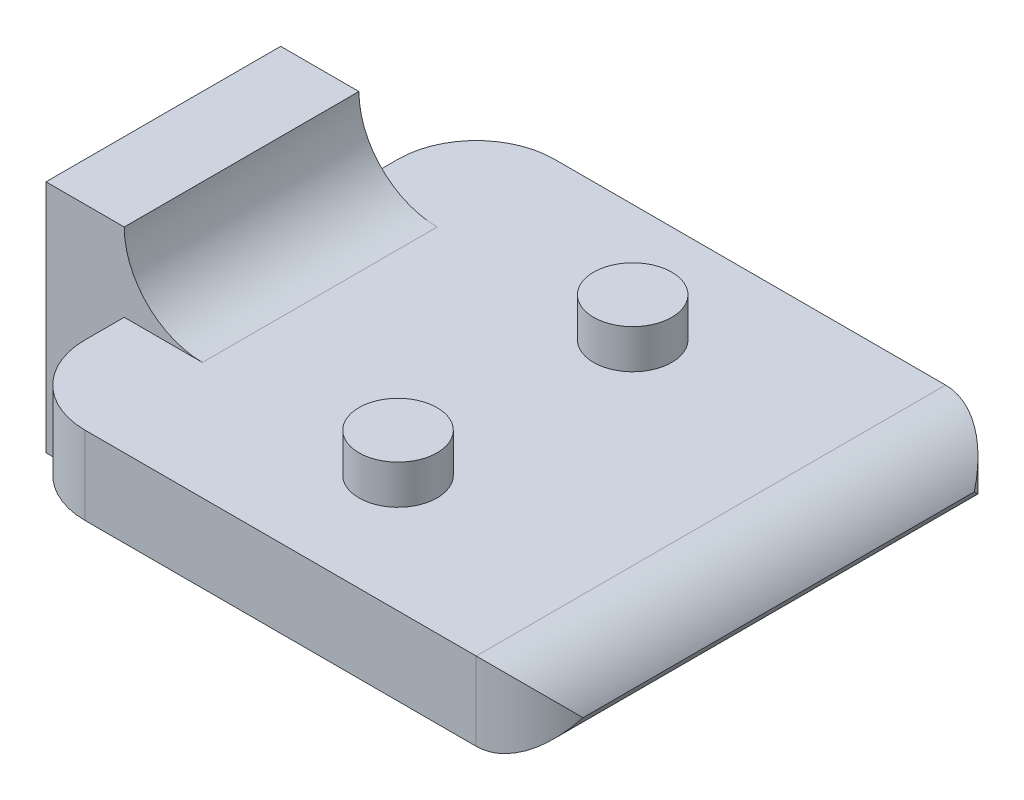
ISO-10303-21;
HEADER;
FILE_DESCRIPTION(('STEP AP214'),'2;1');
FILE_NAME('part.step','',(''),(''),'','','');
FILE_SCHEMA(('AUTOMOTIVE_DESIGN { 1 0 10303 214 1 1 1 1 }'));
ENDSEC;
DATA;
#1=APPLICATION_CONTEXT('core data for automotive mechanical design processes');
#2=APPLICATION_PROTOCOL_DEFINITION('international standard','automotive_design',2000,#1);
#3=PRODUCT_CONTEXT('',#1,'mechanical');
#4=PRODUCT('Part','Part','',(#3));
#5=PRODUCT_RELATED_PRODUCT_CATEGORY('part','',(#4));
#6=PRODUCT_DEFINITION_FORMATION('','',#4);
#7=PRODUCT_DEFINITION_CONTEXT('part definition',#1,'design');
#8=PRODUCT_DEFINITION('design','',#6,#7);
#9=PRODUCT_DEFINITION_SHAPE('','',#8);
#10=(LENGTH_UNIT() NAMED_UNIT(*) SI_UNIT(.MILLI.,.METRE.));
#11=(NAMED_UNIT(*) PLANE_ANGLE_UNIT() SI_UNIT($,.RADIAN.));
#12=(NAMED_UNIT(*) SI_UNIT($,.STERADIAN.) SOLID_ANGLE_UNIT());
#13=UNCERTAINTY_MEASURE_WITH_UNIT(LENGTH_MEASURE(1.E-05),#10,'distance_accuracy_value','');
#14=(GEOMETRIC_REPRESENTATION_CONTEXT(3) GLOBAL_UNCERTAINTY_ASSIGNED_CONTEXT((#13)) GLOBAL_UNIT_ASSIGNED_CONTEXT((#10,
#11,#12)) REPRESENTATION_CONTEXT('',''));
#15=CARTESIAN_POINT('',(0.,0.,0.));
#16=DIRECTION('',(0.,0.,1.));
#17=DIRECTION('',(1.,0.,0.));
#18=AXIS2_PLACEMENT_3D('',#15,#16,#17);
#19=CARTESIAN_POINT('',(25.,10.,0.));
#20=DIRECTION('',(0.,0.,-1.));
#21=DIRECTION('',(-1.,0.,0.));
#22=AXIS2_PLACEMENT_3D('',#19,#20,#21);
#23=CYLINDRICAL_SURFACE('',#22,10.);
#24=CARTESIAN_POINT('',(25.,10.,-20.));
#25=DIRECTION('',(0.,0.707106781186547,-0.707106781186547));
#26=DIRECTION('',(0.,-0.707106781186547,-0.707106781186547));
#27=AXIS2_PLACEMENT_3D('',#24,#25,#26);
#28=ELLIPSE('',#27,14.1421356237309,10.);
#29=CARTESIAN_POINT('',(25.,0.,-30.));
#30=VERTEX_POINT('',#29);
#31=CARTESIAN_POINT('',(33.6602540378444,5.,-25.));
#32=VERTEX_POINT('',#31);
#33=EDGE_CURVE('E335',#30,#32,#28,.F.);
#34=ORIENTED_EDGE('',*,*,#33,.T.);
#35=DIRECTION('',(0.,0.,1.));
#36=VECTOR('',#35,1.);
#37=CARTESIAN_POINT('',(33.6602540378444,5.,0.));
#38=LINE('',#37,#36);
#39=CARTESIAN_POINT('',(33.6602540378444,5.,25.));
#40=VERTEX_POINT('',#39);
#41=EDGE_CURVE('E11',#32,#40,#38,.T.);
#42=ORIENTED_EDGE('',*,*,#41,.T.);
#43=CARTESIAN_POINT('',(25.,10.,20.));
#44=DIRECTION('',(0.,-0.707106781186547,-0.707106781186547));
#45=DIRECTION('',(0.,0.707106781186547,-0.707106781186547));
#46=AXIS2_PLACEMENT_3D('',#43,#44,#45);
#47=ELLIPSE('',#46,14.1421356237309,10.);
#48=CARTESIAN_POINT('',(25.,0.,30.));
#49=VERTEX_POINT('',#48);
#50=EDGE_CURVE('E213',#49,#40,#47,.F.);
#51=ORIENTED_EDGE('',*,*,#50,.F.);
#52=DIRECTION('',(0.,0.,1.));
#53=VECTOR('',#52,1.);
#54=CARTESIAN_POINT('',(25.,0.,30.));
#55=LINE('',#54,#53);
#56=EDGE_CURVE('E314',#30,#49,#55,.T.);
#57=ORIENTED_EDGE('',*,*,#56,.F.);
#58=EDGE_LOOP('',(#34,#42,#51,#57));
#59=FACE_BOUND('',#58,.T.);
#60=ADVANCED_FACE('F41',(#59),#23,.T.);
#61=CARTESIAN_POINT('',(25.,10.,-20.));
#62=DIRECTION('',(0.,-1.,0.));
#63=DIRECTION('',(0.,0.,-1.));
#64=AXIS2_PLACEMENT_3D('',#61,#62,#63);
#65=CYLINDRICAL_SURFACE('',#64,10.);
#66=CARTESIAN_POINT('',(25.,0.,-20.));
#67=DIRECTION('',(0.,-0.707106781186547,-0.707106781186547));
#68=DIRECTION('',(0.,-0.707106781186547,0.707106781186547));
#69=AXIS2_PLACEMENT_3D('',#66,#67,#68);
#70=ELLIPSE('',#69,14.1421356237309,10.);
#71=CARTESIAN_POINT('',(25.,10.,-30.));
#72=VERTEX_POINT('',#71);
#73=EDGE_CURVE('E228',#32,#72,#70,.F.);
#74=ORIENTED_EDGE('',*,*,#73,.F.);
#75=ORIENTED_EDGE('',*,*,#33,.F.);
#76=DIRECTION('',(0.,-1.,0.));
#77=VECTOR('',#76,1.);
#78=CARTESIAN_POINT('',(25.,10.,-30.));
#79=LINE('',#78,#77);
#80=EDGE_CURVE('E300',#72,#30,#79,.T.);
#81=ORIENTED_EDGE('',*,*,#80,.F.);
#82=EDGE_LOOP('',(#74,#75,#81));
#83=FACE_BOUND('',#82,.T.);
#84=ADVANCED_FACE('F337',(#83),#65,.T.);
#85=CARTESIAN_POINT('',(25.,0.,0.));
#86=DIRECTION('',(0.,0.,1.));
#87=DIRECTION('',(1.,0.,0.));
#88=AXIS2_PLACEMENT_3D('',#85,#86,#87);
#89=CYLINDRICAL_SURFACE('',#88,10.);
#90=ORIENTED_EDGE('',*,*,#41,.F.);
#91=ORIENTED_EDGE('',*,*,#73,.T.);
#92=DIRECTION('',(0.,0.,1.));
#93=VECTOR('',#92,1.);
#94=CARTESIAN_POINT('',(25.,10.,0.));
#95=LINE('',#94,#93);
#96=CARTESIAN_POINT('',(25.,10.,30.));
#97=VERTEX_POINT('',#96);
#98=EDGE_CURVE('E293',#97,#72,#95,.F.);
#99=ORIENTED_EDGE('',*,*,#98,.F.);
#100=CARTESIAN_POINT('',(25.,0.,20.));
#101=DIRECTION('',(0.,-0.707106781186547,0.707106781186547));
#102=DIRECTION('',(0.,0.707106781186547,0.707106781186547));
#103=AXIS2_PLACEMENT_3D('',#100,#101,#102);
#104=ELLIPSE('',#103,14.1421356237309,10.);
#105=EDGE_CURVE('E329',#40,#97,#104,.T.);
#106=ORIENTED_EDGE('',*,*,#105,.F.);
#107=EDGE_LOOP('',(#90,#91,#99,#106));
#108=FACE_BOUND('',#107,.T.);
#109=ADVANCED_FACE('F333',(#108),#89,.T.);
#110=CARTESIAN_POINT('',(25.,10.,20.));
#111=DIRECTION('',(0.,1.,0.));
#112=DIRECTION('',(0.,0.,1.));
#113=AXIS2_PLACEMENT_3D('',#110,#111,#112);
#114=CYLINDRICAL_SURFACE('',#113,10.);
#115=ORIENTED_EDGE('',*,*,#50,.T.);
#116=ORIENTED_EDGE('',*,*,#105,.T.);
#117=DIRECTION('',(0.,-1.,0.));
#118=VECTOR('',#117,1.);
#119=CARTESIAN_POINT('',(25.,10.,30.));
#120=LINE('',#119,#118);
#121=EDGE_CURVE('E278',#49,#97,#120,.F.);
#122=ORIENTED_EDGE('',*,*,#121,.F.);
#123=EDGE_LOOP('',(#115,#116,#122));
#124=FACE_BOUND('',#123,.T.);
#125=ADVANCED_FACE('F352',(#124),#114,.T.);
#126=CARTESIAN_POINT('',(0.,10.,-15.));
#127=DIRECTION('',(0.,0.,1.));
#128=DIRECTION('',(1.,0.,0.));
#129=AXIS2_PLACEMENT_3D('',#126,#127,#128);
#130=PLANE('',#129);
#131=DIRECTION('',(0.,-1.,0.));
#132=VECTOR('',#131,1.);
#133=CARTESIAN_POINT('',(-35.,10.,-15.));
#134=LINE('',#133,#132);
#135=CARTESIAN_POINT('',(-35.,10.,-15.));
#136=VERTEX_POINT('',#135);
#137=CARTESIAN_POINT('',(-35.,0.,-15.));
#138=VERTEX_POINT('',#137);
#139=EDGE_CURVE('E270',#136,#138,#134,.T.);
#140=ORIENTED_EDGE('',*,*,#139,.T.);
#141=DIRECTION('',(-1.,0.,0.));
#142=VECTOR('',#141,1.);
#143=CARTESIAN_POINT('',(0.,0.,-15.));
#144=LINE('',#143,#142);
#145=CARTESIAN_POINT('',(-25.,0.,-15.));
#146=VERTEX_POINT('',#145);
#147=EDGE_CURVE('E315',#146,#138,#144,.T.);
#148=ORIENTED_EDGE('',*,*,#147,.F.);
#149=CARTESIAN_POINT('',(-25.,-10.,-15.));
#150=DIRECTION('',(0.,0.,1.));
#151=DIRECTION('',(1.,0.,0.));
#152=AXIS2_PLACEMENT_3D('',#149,#150,#151);
#153=CIRCLE('',#152,10.);
#154=CARTESIAN_POINT('',(-35.,-10.,-15.));
#155=VERTEX_POINT('',#154);
#156=EDGE_CURVE('E321',#146,#155,#153,.T.);
#157=ORIENTED_EDGE('',*,*,#156,.T.);
#158=DIRECTION('',(-1.,0.,0.));
#159=VECTOR('',#158,1.);
#160=CARTESIAN_POINT('',(-35.,-10.,-15.));
#161=LINE('',#160,#159);
#162=CARTESIAN_POINT('',(-45.,-10.,-15.));
#163=VERTEX_POINT('',#162);
#164=EDGE_CURVE('E236',#155,#163,#161,.T.);
#165=ORIENTED_EDGE('',*,*,#164,.T.);
#166=DIRECTION('',(0.,-1.,0.));
#167=VECTOR('',#166,1.);
#168=CARTESIAN_POINT('',(-45.,10.,-15.));
#169=LINE('',#168,#167);
#170=CARTESIAN_POINT('',(-45.,20.,-15.));
#171=VERTEX_POINT('',#170);
#172=EDGE_CURVE('E274',#171,#163,#169,.T.);
#173=ORIENTED_EDGE('',*,*,#172,.F.);
#174=DIRECTION('',(-1.,0.,0.));
#175=VECTOR('',#174,1.);
#176=CARTESIAN_POINT('',(-35.,20.,-15.));
#177=LINE('',#176,#175);
#178=CARTESIAN_POINT('',(-35.,20.,-15.));
#179=VERTEX_POINT('',#178);
#180=EDGE_CURVE('E223',#179,#171,#177,.T.);
#181=ORIENTED_EDGE('',*,*,#180,.F.);
#182=CARTESIAN_POINT('',(-25.,20.,-15.));
#183=DIRECTION('',(0.,0.,1.));
#184=DIRECTION('',(1.,0.,0.));
#185=AXIS2_PLACEMENT_3D('',#182,#183,#184);
#186=CIRCLE('',#185,10.);
#187=CARTESIAN_POINT('',(-25.,10.,-15.));
#188=VERTEX_POINT('',#187);
#189=EDGE_CURVE('E324',#179,#188,#186,.T.);
#190=ORIENTED_EDGE('',*,*,#189,.T.);
#191=DIRECTION('',(1.,0.,0.));
#192=VECTOR('',#191,1.);
#193=CARTESIAN_POINT('',(0.,10.,-15.));
#194=LINE('',#193,#192);
#195=EDGE_CURVE('E295',#136,#188,#194,.T.);
#196=ORIENTED_EDGE('',*,*,#195,.F.);
#197=EDGE_LOOP('',(#140,#148,#157,#165,#173,#181,#190,#196));
#198=FACE_BOUND('',#197,.T.);
#199=ADVANCED_FACE('F380',(#198),#130,.F.);
#200=CARTESIAN_POINT('',(-45.,10.,0.));
#201=DIRECTION('',(1.,0.,0.));
#202=DIRECTION('',(0.,0.,-1.));
#203=AXIS2_PLACEMENT_3D('',#200,#201,#202);
#204=PLANE('',#203);
#205=DIRECTION('',(0.,0.,-1.));
#206=VECTOR('',#205,1.);
#207=CARTESIAN_POINT('',(-45.,8.19970086177524,-8.13904491053576));
#208=LINE('',#207,#206);
#209=CARTESIAN_POINT('',(-45.,8.19970086177524,8.13904491053578));
#210=VERTEX_POINT('',#209);
#211=CARTESIAN_POINT('',(-45.,8.19970086177524,-8.13904491053576));
#212=VERTEX_POINT('',#211);
#213=EDGE_CURVE('E199',#210,#212,#208,.T.);
#214=ORIENTED_EDGE('',*,*,#213,.F.);
#215=DIRECTION('',(0.,1.,0.));
#216=VECTOR('',#215,1.);
#217=CARTESIAN_POINT('',(-45.,8.19970086177524,8.13904491053578));
#218=LINE('',#217,#216);
#219=CARTESIAN_POINT('',(-45.,1.80029913822476,8.13904491053578));
#220=VERTEX_POINT('',#219);
#221=EDGE_CURVE('E57',#220,#210,#218,.T.);
#222=ORIENTED_EDGE('',*,*,#221,.F.);
#223=DIRECTION('',(0.,0.,1.));
#224=VECTOR('',#223,1.);
#225=CARTESIAN_POINT('',(-45.,1.80029913822476,-8.13904491053576));
#226=LINE('',#225,#224);
#227=CARTESIAN_POINT('',(-45.,1.80029913822476,-8.13904491053576));
#228=VERTEX_POINT('',#227);
#229=EDGE_CURVE('E193',#228,#220,#226,.T.);
#230=ORIENTED_EDGE('',*,*,#229,.F.);
#231=DIRECTION('',(0.,-1.,0.));
#232=VECTOR('',#231,1.);
#233=CARTESIAN_POINT('',(-45.,8.19970086177524,-8.13904491053576));
#234=LINE('',#233,#232);
#235=EDGE_CURVE('E195',#212,#228,#234,.T.);
#236=ORIENTED_EDGE('',*,*,#235,.F.);
#237=EDGE_LOOP('',(#214,#222,#230,#236));
#238=FACE_BOUND('',#237,.T.);
#239=ORIENTED_EDGE('',*,*,#172,.T.);
#240=DIRECTION('',(0.,0.,1.));
#241=VECTOR('',#240,1.);
#242=CARTESIAN_POINT('',(-45.,-10.,-15.));
#243=LINE('',#242,#241);
#244=CARTESIAN_POINT('',(-45.,-10.,15.));
#245=VERTEX_POINT('',#244);
#246=EDGE_CURVE('E243',#163,#245,#243,.T.);
#247=ORIENTED_EDGE('',*,*,#246,.T.);
#248=DIRECTION('',(0.,-1.,0.));
#249=VECTOR('',#248,1.);
#250=CARTESIAN_POINT('',(-45.,10.,15.));
#251=LINE('',#250,#249);
#252=CARTESIAN_POINT('',(-45.,20.,15.));
#253=VERTEX_POINT('',#252);
#254=EDGE_CURVE('E272',#253,#245,#251,.T.);
#255=ORIENTED_EDGE('',*,*,#254,.F.);
#256=DIRECTION('',(0.,0.,1.));
#257=VECTOR('',#256,1.);
#258=CARTESIAN_POINT('',(-45.,20.,-15.));
#259=LINE('',#258,#257);
#260=EDGE_CURVE('E230',#171,#253,#259,.T.);
#261=ORIENTED_EDGE('',*,*,#260,.F.);
#262=EDGE_LOOP('',(#239,#247,#255,#261));
#263=FACE_BOUND('',#262,.T.);
#264=ADVANCED_FACE('F400',(#238,#263),#204,.F.);
#265=CARTESIAN_POINT('',(0.,10.,15.));
#266=DIRECTION('',(0.,0.,1.));
#267=DIRECTION('',(1.,0.,0.));
#268=AXIS2_PLACEMENT_3D('',#265,#266,#267);
#269=PLANE('',#268);
#270=ORIENTED_EDGE('',*,*,#254,.T.);
#271=DIRECTION('',(1.,0.,0.));
#272=VECTOR('',#271,1.);
#273=CARTESIAN_POINT('',(-35.,-10.,15.));
#274=LINE('',#273,#272);
#275=CARTESIAN_POINT('',(-35.,-10.,15.));
#276=VERTEX_POINT('',#275);
#277=EDGE_CURVE('E245',#245,#276,#274,.T.);
#278=ORIENTED_EDGE('',*,*,#277,.T.);
#279=CARTESIAN_POINT('',(-25.,-10.,15.));
#280=DIRECTION('',(0.,0.,1.));
#281=DIRECTION('',(1.,0.,0.));
#282=AXIS2_PLACEMENT_3D('',#279,#280,#281);
#283=CIRCLE('',#282,10.);
#284=CARTESIAN_POINT('',(-25.,0.,15.));
#285=VERTEX_POINT('',#284);
#286=EDGE_CURVE('E323',#276,#285,#283,.F.);
#287=ORIENTED_EDGE('',*,*,#286,.T.);
#288=DIRECTION('',(1.,0.,0.));
#289=VECTOR('',#288,1.);
#290=CARTESIAN_POINT('',(0.,0.,15.));
#291=LINE('',#290,#289);
#292=CARTESIAN_POINT('',(-35.,0.,15.));
#293=VERTEX_POINT('',#292);
#294=EDGE_CURVE('E308',#293,#285,#291,.T.);
#295=ORIENTED_EDGE('',*,*,#294,.F.);
#296=DIRECTION('',(0.,-1.,0.));
#297=VECTOR('',#296,1.);
#298=CARTESIAN_POINT('',(-35.,10.,15.));
#299=LINE('',#298,#297);
#300=CARTESIAN_POINT('',(-35.,10.,15.));
#301=VERTEX_POINT('',#300);
#302=EDGE_CURVE('E269',#301,#293,#299,.T.);
#303=ORIENTED_EDGE('',*,*,#302,.F.);
#304=DIRECTION('',(-1.,0.,0.));
#305=VECTOR('',#304,1.);
#306=CARTESIAN_POINT('',(0.,10.,15.));
#307=LINE('',#306,#305);
#308=CARTESIAN_POINT('',(-25.,10.,15.));
#309=VERTEX_POINT('',#308);
#310=EDGE_CURVE('E289',#309,#301,#307,.T.);
#311=ORIENTED_EDGE('',*,*,#310,.F.);
#312=CARTESIAN_POINT('',(-25.,20.,15.));
#313=DIRECTION('',(0.,0.,1.));
#314=DIRECTION('',(1.,0.,0.));
#315=AXIS2_PLACEMENT_3D('',#312,#313,#314);
#316=CIRCLE('',#315,10.);
#317=CARTESIAN_POINT('',(-35.,20.,15.));
#318=VERTEX_POINT('',#317);
#319=EDGE_CURVE('E47',#309,#318,#316,.F.);
#320=ORIENTED_EDGE('',*,*,#319,.T.);
#321=DIRECTION('',(1.,0.,0.));
#322=VECTOR('',#321,1.);
#323=CARTESIAN_POINT('',(-35.,20.,15.));
#324=LINE('',#323,#322);
#325=EDGE_CURVE('E234',#253,#318,#324,.T.);
#326=ORIENTED_EDGE('',*,*,#325,.F.);
#327=EDGE_LOOP('',(#270,#278,#287,#295,#303,#311,#320,#326));
#328=FACE_BOUND('',#327,.T.);
#329=ADVANCED_FACE('F369',(#328),#269,.T.);
#330=CARTESIAN_POINT('',(-35.,10.,0.));
#331=DIRECTION('',(1.,0.,0.));
#332=DIRECTION('',(0.,0.,-1.));
#333=AXIS2_PLACEMENT_3D('',#330,#331,#332);
#334=PLANE('',#333);
#335=DIRECTION('',(0.,0.,1.));
#336=VECTOR('',#335,1.);
#337=CARTESIAN_POINT('',(-35.,0.,0.));
#338=LINE('',#337,#336);
#339=CARTESIAN_POINT('',(-35.,0.,20.));
#340=VERTEX_POINT('',#339);
#341=EDGE_CURVE('E249',#293,#340,#338,.T.);
#342=ORIENTED_EDGE('',*,*,#341,.T.);
#343=DIRECTION('',(0.,-1.,0.));
#344=VECTOR('',#343,1.);
#345=CARTESIAN_POINT('',(-35.,10.,20.));
#346=LINE('',#345,#344);
#347=CARTESIAN_POINT('',(-35.,10.,20.));
#348=VERTEX_POINT('',#347);
#349=EDGE_CURVE('E317',#340,#348,#346,.F.);
#350=ORIENTED_EDGE('',*,*,#349,.T.);
#351=DIRECTION('',(0.,0.,1.));
#352=VECTOR('',#351,1.);
#353=CARTESIAN_POINT('',(-35.,10.,0.));
#354=LINE('',#353,#352);
#355=EDGE_CURVE('E247',#301,#348,#354,.T.);
#356=ORIENTED_EDGE('',*,*,#355,.F.);
#357=ORIENTED_EDGE('',*,*,#302,.T.);
#358=EDGE_LOOP('',(#342,#350,#356,#357));
#359=FACE_BOUND('',#358,.T.);
#360=ADVANCED_FACE('F368',(#359),#334,.F.);
#361=CARTESIAN_POINT('',(0.,10.,30.));
#362=DIRECTION('',(0.,0.,-1.));
#363=DIRECTION('',(-1.,0.,0.));
#364=AXIS2_PLACEMENT_3D('',#361,#362,#363);
#365=PLANE('',#364);
#366=DIRECTION('',(1.,0.,0.));
#367=VECTOR('',#366,1.);
#368=CARTESIAN_POINT('',(0.,0.,30.));
#369=LINE('',#368,#367);
#370=CARTESIAN_POINT('',(-25.,0.,30.));
#371=VERTEX_POINT('',#370);
#372=EDGE_CURVE('E261',#371,#49,#369,.T.);
#373=ORIENTED_EDGE('',*,*,#372,.T.);
#374=ORIENTED_EDGE('',*,*,#121,.T.);
#375=DIRECTION('',(1.,0.,0.));
#376=VECTOR('',#375,1.);
#377=CARTESIAN_POINT('',(0.,10.,30.));
#378=LINE('',#377,#376);
#379=CARTESIAN_POINT('',(-25.,10.,30.));
#380=VERTEX_POINT('',#379);
#381=EDGE_CURVE('E253',#380,#97,#378,.T.);
#382=ORIENTED_EDGE('',*,*,#381,.F.);
#383=DIRECTION('',(0.,-1.,0.));
#384=VECTOR('',#383,1.);
#385=CARTESIAN_POINT('',(-25.,10.,30.));
#386=LINE('',#385,#384);
#387=EDGE_CURVE('E280',#380,#371,#386,.T.);
#388=ORIENTED_EDGE('',*,*,#387,.T.);
#389=EDGE_LOOP('',(#373,#374,#382,#388));
#390=FACE_BOUND('',#389,.T.);
#391=ADVANCED_FACE('F358',(#390),#365,.F.);
#392=CARTESIAN_POINT('',(0.,10.,-30.));
#393=DIRECTION('',(0.,0.,-1.));
#394=DIRECTION('',(-1.,0.,0.));
#395=AXIS2_PLACEMENT_3D('',#392,#393,#394);
#396=PLANE('',#395);
#397=DIRECTION('',(1.,0.,0.));
#398=VECTOR('',#397,1.);
#399=CARTESIAN_POINT('',(0.,10.,-30.));
#400=LINE('',#399,#398);
#401=CARTESIAN_POINT('',(-25.,10.,-30.));
#402=VERTEX_POINT('',#401);
#403=EDGE_CURVE('E258',#402,#72,#400,.T.);
#404=ORIENTED_EDGE('',*,*,#403,.T.);
#405=ORIENTED_EDGE('',*,*,#80,.T.);
#406=DIRECTION('',(1.,0.,0.));
#407=VECTOR('',#406,1.);
#408=CARTESIAN_POINT('',(0.,0.,-30.));
#409=LINE('',#408,#407);
#410=CARTESIAN_POINT('',(-25.,0.,-30.));
#411=VERTEX_POINT('',#410);
#412=EDGE_CURVE('E262',#411,#30,#409,.T.);
#413=ORIENTED_EDGE('',*,*,#412,.F.);
#414=DIRECTION('',(0.,-1.,0.));
#415=VECTOR('',#414,1.);
#416=CARTESIAN_POINT('',(-25.,10.,-30.));
#417=LINE('',#416,#415);
#418=EDGE_CURVE('E299',#411,#402,#417,.F.);
#419=ORIENTED_EDGE('',*,*,#418,.T.);
#420=EDGE_LOOP('',(#404,#405,#413,#419));
#421=FACE_BOUND('',#420,.T.);
#422=ADVANCED_FACE('F343',(#421),#396,.T.);
#423=CARTESIAN_POINT('',(-35.,10.,-20.));
#424=VERTEX_POINT('',#423);
#425=EDGE_CURVE('E251',#424,#136,#354,.T.);
#426=ORIENTED_EDGE('',*,*,#425,.F.);
#427=DIRECTION('',(0.,-1.,0.));
#428=VECTOR('',#427,1.);
#429=CARTESIAN_POINT('',(-35.,0.,-20.));
#430=LINE('',#429,#428);
#431=CARTESIAN_POINT('',(-35.,0.,-20.));
#432=VERTEX_POINT('',#431);
#433=EDGE_CURVE('E316',#424,#432,#430,.T.);
#434=ORIENTED_EDGE('',*,*,#433,.T.);
#435=EDGE_CURVE('E252',#432,#138,#338,.T.);
#436=ORIENTED_EDGE('',*,*,#435,.T.);
#437=ORIENTED_EDGE('',*,*,#139,.F.);
#438=EDGE_LOOP('',(#426,#434,#436,#437));
#439=FACE_BOUND('',#438,.T.);
#440=ADVANCED_FACE('F385',(#439),#334,.F.);
#441=CARTESIAN_POINT('',(0.,10.,0.));
#442=DIRECTION('',(0.,1.,0.));
#443=DIRECTION('',(0.,0.,1.));
#444=AXIS2_PLACEMENT_3D('',#441,#442,#443);
#445=PLANE('',#444);
#446=CARTESIAN_POINT('',(0.,10.,-15.));
#447=DIRECTION('',(0.,1.,0.));
#448=DIRECTION('',(0.,0.,1.));
#449=AXIS2_PLACEMENT_3D('',#446,#447,#448);
#450=CIRCLE('',#449,5.);
#451=CARTESIAN_POINT('',(0.,10.,-10.));
#452=VERTEX_POINT('',#451);
#453=EDGE_CURVE('E212',#452,#452,#450,.T.);
#454=ORIENTED_EDGE('',*,*,#453,.F.);
#455=EDGE_LOOP('',(#454));
#456=FACE_BOUND('',#455,.T.);
#457=CARTESIAN_POINT('',(0.,10.,15.));
#458=DIRECTION('',(0.,1.,0.));
#459=DIRECTION('',(0.,0.,1.));
#460=AXIS2_PLACEMENT_3D('',#457,#458,#459);
#461=CIRCLE('',#460,5.);
#462=CARTESIAN_POINT('',(0.,10.,20.));
#463=VERTEX_POINT('',#462);
#464=EDGE_CURVE('E220',#463,#463,#461,.T.);
#465=ORIENTED_EDGE('',*,*,#464,.F.);
#466=EDGE_LOOP('',(#465));
#467=FACE_BOUND('',#466,.T.);
#468=ORIENTED_EDGE('',*,*,#381,.T.);
#469=ORIENTED_EDGE('',*,*,#98,.T.);
#470=ORIENTED_EDGE('',*,*,#403,.F.);
#471=CARTESIAN_POINT('',(-25.,10.,-20.));
#472=DIRECTION('',(0.,1.,0.));
#473=DIRECTION('',(0.,0.,1.));
#474=AXIS2_PLACEMENT_3D('',#471,#472,#473);
#475=CIRCLE('',#474,10.);
#476=EDGE_CURVE('E281',#402,#424,#475,.T.);
#477=ORIENTED_EDGE('',*,*,#476,.T.);
#478=ORIENTED_EDGE('',*,*,#425,.T.);
#479=ORIENTED_EDGE('',*,*,#195,.T.);
#480=DIRECTION('',(0.,0.,-1.));
#481=VECTOR('',#480,1.);
#482=CARTESIAN_POINT('',(-25.,10.,15.));
#483=LINE('',#482,#481);
#484=EDGE_CURVE('E290',#188,#309,#483,.F.);
#485=ORIENTED_EDGE('',*,*,#484,.T.);
#486=ORIENTED_EDGE('',*,*,#310,.T.);
#487=ORIENTED_EDGE('',*,*,#355,.T.);
#488=CARTESIAN_POINT('',(-25.,10.,20.));
#489=DIRECTION('',(0.,1.,0.));
#490=DIRECTION('',(0.,0.,1.));
#491=AXIS2_PLACEMENT_3D('',#488,#489,#490);
#492=CIRCLE('',#491,10.);
#493=EDGE_CURVE('E282',#348,#380,#492,.T.);
#494=ORIENTED_EDGE('',*,*,#493,.T.);
#495=EDGE_LOOP('',(#468,#469,#470,#477,#478,#479,#485,#486,#487,#494));
#496=FACE_BOUND('',#495,.T.);
#497=ADVANCED_FACE('F360',(#456,#467,#496),#445,.T.);
#498=CARTESIAN_POINT('',(0.,0.,0.));
#499=DIRECTION('',(0.,1.,0.));
#500=DIRECTION('',(0.,0.,1.));
#501=AXIS2_PLACEMENT_3D('',#498,#499,#500);
#502=PLANE('',#501);
#503=ORIENTED_EDGE('',*,*,#412,.T.);
#504=ORIENTED_EDGE('',*,*,#56,.T.);
#505=ORIENTED_EDGE('',*,*,#372,.F.);
#506=CARTESIAN_POINT('',(-25.,0.,20.));
#507=DIRECTION('',(0.,1.,0.));
#508=DIRECTION('',(0.,0.,1.));
#509=AXIS2_PLACEMENT_3D('',#506,#507,#508);
#510=CIRCLE('',#509,10.);
#511=EDGE_CURVE('E304',#371,#340,#510,.F.);
#512=ORIENTED_EDGE('',*,*,#511,.T.);
#513=ORIENTED_EDGE('',*,*,#341,.F.);
#514=ORIENTED_EDGE('',*,*,#294,.T.);
#515=DIRECTION('',(0.,0.,-1.));
#516=VECTOR('',#515,1.);
#517=CARTESIAN_POINT('',(-25.,0.,0.));
#518=LINE('',#517,#516);
#519=EDGE_CURVE('E310',#285,#146,#518,.T.);
#520=ORIENTED_EDGE('',*,*,#519,.T.);
#521=ORIENTED_EDGE('',*,*,#147,.T.);
#522=ORIENTED_EDGE('',*,*,#435,.F.);
#523=CARTESIAN_POINT('',(-25.,0.,-20.));
#524=DIRECTION('',(0.,1.,0.));
#525=DIRECTION('',(0.,0.,1.));
#526=AXIS2_PLACEMENT_3D('',#523,#524,#525);
#527=CIRCLE('',#526,10.);
#528=EDGE_CURVE('E305',#432,#411,#527,.F.);
#529=ORIENTED_EDGE('',*,*,#528,.T.);
#530=EDGE_LOOP('',(#503,#504,#505,#512,#513,#514,#520,#521,#522,#529));
#531=FACE_BOUND('',#530,.T.);
#532=ADVANCED_FACE('F347',(#531),#502,.F.);
#533=CARTESIAN_POINT('',(0.,-10.,0.));
#534=DIRECTION('',(0.,-1.,0.));
#535=DIRECTION('',(0.,0.,-1.));
#536=AXIS2_PLACEMENT_3D('',#533,#534,#535);
#537=PLANE('',#536);
#538=DIRECTION('',(0.,0.,-1.));
#539=VECTOR('',#538,1.);
#540=CARTESIAN_POINT('',(-35.,-10.,-15.));
#541=LINE('',#540,#539);
#542=EDGE_CURVE('E231',#276,#155,#541,.T.);
#543=ORIENTED_EDGE('',*,*,#542,.F.);
#544=ORIENTED_EDGE('',*,*,#277,.F.);
#545=ORIENTED_EDGE('',*,*,#246,.F.);
#546=ORIENTED_EDGE('',*,*,#164,.F.);
#547=EDGE_LOOP('',(#543,#544,#545,#546));
#548=FACE_BOUND('',#547,.T.);
#549=ADVANCED_FACE('F401',(#548),#537,.T.);
#550=CARTESIAN_POINT('',(0.,20.,0.));
#551=DIRECTION('',(0.,-1.,0.));
#552=DIRECTION('',(0.,0.,-1.));
#553=AXIS2_PLACEMENT_3D('',#550,#551,#552);
#554=PLANE('',#553);
#555=DIRECTION('',(0.,0.,-1.));
#556=VECTOR('',#555,1.);
#557=CARTESIAN_POINT('',(-35.,20.,-15.));
#558=LINE('',#557,#556);
#559=EDGE_CURVE('E225',#318,#179,#558,.T.);
#560=ORIENTED_EDGE('',*,*,#559,.T.);
#561=ORIENTED_EDGE('',*,*,#180,.T.);
#562=ORIENTED_EDGE('',*,*,#260,.T.);
#563=ORIENTED_EDGE('',*,*,#325,.T.);
#564=EDGE_LOOP('',(#560,#561,#562,#563));
#565=FACE_BOUND('',#564,.T.);
#566=ADVANCED_FACE('F398',(#565),#554,.F.);
#567=CARTESIAN_POINT('',(-25.,-10.,0.));
#568=DIRECTION('',(0.,0.,-1.));
#569=DIRECTION('',(-1.,0.,0.));
#570=AXIS2_PLACEMENT_3D('',#567,#568,#569);
#571=CYLINDRICAL_SURFACE('',#570,10.);
#572=ORIENTED_EDGE('',*,*,#286,.F.);
#573=ORIENTED_EDGE('',*,*,#542,.T.);
#574=ORIENTED_EDGE('',*,*,#156,.F.);
#575=ORIENTED_EDGE('',*,*,#519,.F.);
#576=EDGE_LOOP('',(#572,#573,#574,#575));
#577=FACE_BOUND('',#576,.T.);
#578=ADVANCED_FACE('F373',(#577),#571,.F.);
#579=CARTESIAN_POINT('',(-25.,20.,-15.));
#580=DIRECTION('',(0.,0.,1.));
#581=DIRECTION('',(1.,0.,0.));
#582=AXIS2_PLACEMENT_3D('',#579,#580,#581);
#583=CYLINDRICAL_SURFACE('',#582,10.);
#584=ORIENTED_EDGE('',*,*,#319,.F.);
#585=ORIENTED_EDGE('',*,*,#484,.F.);
#586=ORIENTED_EDGE('',*,*,#189,.F.);
#587=ORIENTED_EDGE('',*,*,#559,.F.);
#588=EDGE_LOOP('',(#584,#585,#586,#587));
#589=FACE_BOUND('',#588,.T.);
#590=ADVANCED_FACE('F393',(#589),#583,.F.);
#591=CARTESIAN_POINT('',(-25.,10.,-20.));
#592=DIRECTION('',(0.,1.,0.));
#593=DIRECTION('',(0.,0.,1.));
#594=AXIS2_PLACEMENT_3D('',#591,#592,#593);
#595=CYLINDRICAL_SURFACE('',#594,10.);
#596=ORIENTED_EDGE('',*,*,#476,.F.);
#597=ORIENTED_EDGE('',*,*,#418,.F.);
#598=ORIENTED_EDGE('',*,*,#528,.F.);
#599=ORIENTED_EDGE('',*,*,#433,.F.);
#600=EDGE_LOOP('',(#596,#597,#598,#599));
#601=FACE_BOUND('',#600,.T.);
#602=ADVANCED_FACE('F390',(#601),#595,.T.);
#603=CARTESIAN_POINT('',(-25.,10.,20.));
#604=DIRECTION('',(0.,-1.,0.));
#605=DIRECTION('',(0.,0.,-1.));
#606=AXIS2_PLACEMENT_3D('',#603,#604,#605);
#607=CYLINDRICAL_SURFACE('',#606,10.);
#608=ORIENTED_EDGE('',*,*,#493,.F.);
#609=ORIENTED_EDGE('',*,*,#349,.F.);
#610=ORIENTED_EDGE('',*,*,#511,.F.);
#611=ORIENTED_EDGE('',*,*,#387,.F.);
#612=EDGE_LOOP('',(#608,#609,#610,#611));
#613=FACE_BOUND('',#612,.T.);
#614=ADVANCED_FACE('F43',(#613),#607,.T.);
#615=CARTESIAN_POINT('',(0.,15.,15.));
#616=DIRECTION('',(0.,-1.,0.));
#617=DIRECTION('',(0.,0.,-1.));
#618=AXIS2_PLACEMENT_3D('',#615,#616,#617);
#619=CYLINDRICAL_SURFACE('',#618,5.);
#620=CARTESIAN_POINT('',(0.,15.,15.));
#621=DIRECTION('',(0.,1.,0.));
#622=DIRECTION('',(0.,0.,1.));
#623=AXIS2_PLACEMENT_3D('',#620,#621,#622);
#624=CIRCLE('',#623,5.);
#625=CARTESIAN_POINT('',(0.,15.,20.));
#626=VERTEX_POINT('',#625);
#627=EDGE_CURVE('E206',#626,#626,#624,.T.);
#628=ORIENTED_EDGE('',*,*,#627,.F.);
#629=EDGE_LOOP('',(#628));
#630=FACE_BOUND('',#629,.T.);
#631=ORIENTED_EDGE('',*,*,#464,.T.);
#632=EDGE_LOOP('',(#631));
#633=FACE_BOUND('',#632,.T.);
#634=ADVANCED_FACE('F431',(#630,#633),#619,.T.);
#635=CARTESIAN_POINT('',(0.,15.,15.));
#636=DIRECTION('',(0.,1.,0.));
#637=DIRECTION('',(0.,0.,1.));
#638=AXIS2_PLACEMENT_3D('',#635,#636,#637);
#639=PLANE('',#638);
#640=ORIENTED_EDGE('',*,*,#627,.T.);
#641=EDGE_LOOP('',(#640));
#642=FACE_BOUND('',#641,.T.);
#643=ADVANCED_FACE('F436',(#642),#639,.T.);
#644=CARTESIAN_POINT('',(0.,15.,-15.));
#645=DIRECTION('',(0.,-1.,0.));
#646=DIRECTION('',(0.,0.,-1.));
#647=AXIS2_PLACEMENT_3D('',#644,#645,#646);
#648=CYLINDRICAL_SURFACE('',#647,5.);
#649=CARTESIAN_POINT('',(0.,15.,-15.));
#650=DIRECTION('',(0.,1.,0.));
#651=DIRECTION('',(0.,0.,1.));
#652=AXIS2_PLACEMENT_3D('',#649,#650,#651);
#653=CIRCLE('',#652,5.);
#654=CARTESIAN_POINT('',(0.,15.,-10.));
#655=VERTEX_POINT('',#654);
#656=EDGE_CURVE('E209',#655,#655,#653,.T.);
#657=ORIENTED_EDGE('',*,*,#656,.F.);
#658=EDGE_LOOP('',(#657));
#659=FACE_BOUND('',#658,.T.);
#660=ORIENTED_EDGE('',*,*,#453,.T.);
#661=EDGE_LOOP('',(#660));
#662=FACE_BOUND('',#661,.T.);
#663=ADVANCED_FACE('F445',(#659,#662),#648,.T.);
#664=CARTESIAN_POINT('',(0.,15.,-15.));
#665=DIRECTION('',(0.,1.,0.));
#666=DIRECTION('',(0.,0.,1.));
#667=AXIS2_PLACEMENT_3D('',#664,#665,#666);
#668=PLANE('',#667);
#669=ORIENTED_EDGE('',*,*,#656,.T.);
#670=EDGE_LOOP('',(#669));
#671=FACE_BOUND('',#670,.T.);
#672=ADVANCED_FACE('F446',(#671),#668,.T.);
#673=CARTESIAN_POINT('',(-40.,8.19970086177524,8.13904491053578));
#674=DIRECTION('',(0.,0.,1.));
#675=DIRECTION('',(1.,0.,0.));
#676=AXIS2_PLACEMENT_3D('',#673,#674,#675);
#677=PLANE('',#676);
#678=ORIENTED_EDGE('',*,*,#221,.T.);
#679=DIRECTION('',(-1.,0.,0.));
#680=VECTOR('',#679,1.);
#681=CARTESIAN_POINT('',(-40.,8.19970086177524,8.13904491053578));
#682=LINE('',#681,#680);
#683=CARTESIAN_POINT('',(-40.,8.19970086177524,8.13904491053578));
#684=VERTEX_POINT('',#683);
#685=EDGE_CURVE('E166',#684,#210,#682,.T.);
#686=ORIENTED_EDGE('',*,*,#685,.F.);
#687=DIRECTION('',(0.,1.,0.));
#688=VECTOR('',#687,1.);
#689=CARTESIAN_POINT('',(-40.,8.19970086177524,8.13904491053578));
#690=LINE('',#689,#688);
#691=CARTESIAN_POINT('',(-40.,1.80029913822476,8.13904491053578));
#692=VERTEX_POINT('',#691);
#693=EDGE_CURVE('E172',#692,#684,#690,.T.);
#694=ORIENTED_EDGE('',*,*,#693,.F.);
#695=DIRECTION('',(-1.,0.,0.));
#696=VECTOR('',#695,1.);
#697=CARTESIAN_POINT('',(-40.,1.80029913822476,8.13904491053578));
#698=LINE('',#697,#696);
#699=EDGE_CURVE('E204',#692,#220,#698,.T.);
#700=ORIENTED_EDGE('',*,*,#699,.T.);
#701=EDGE_LOOP('',(#678,#686,#694,#700));
#702=FACE_BOUND('',#701,.T.);
#703=ADVANCED_FACE('F173',(#702),#677,.F.);
#704=CARTESIAN_POINT('',(-40.,1.80029913822476,-8.13904491053576));
#705=DIRECTION('',(0.,-1.,0.));
#706=DIRECTION('',(0.,0.,-1.));
#707=AXIS2_PLACEMENT_3D('',#704,#705,#706);
#708=PLANE('',#707);
#709=ORIENTED_EDGE('',*,*,#229,.T.);
#710=ORIENTED_EDGE('',*,*,#699,.F.);
#711=DIRECTION('',(0.,0.,1.));
#712=VECTOR('',#711,1.);
#713=CARTESIAN_POINT('',(-40.,1.80029913822476,-8.13904491053576));
#714=LINE('',#713,#712);
#715=CARTESIAN_POINT('',(-40.,1.80029913822476,-8.13904491053576));
#716=VERTEX_POINT('',#715);
#717=EDGE_CURVE('E180',#716,#692,#714,.T.);
#718=ORIENTED_EDGE('',*,*,#717,.F.);
#719=DIRECTION('',(-1.,0.,0.));
#720=VECTOR('',#719,1.);
#721=CARTESIAN_POINT('',(-40.,1.80029913822476,-8.13904491053576));
#722=LINE('',#721,#720);
#723=EDGE_CURVE('E210',#716,#228,#722,.T.);
#724=ORIENTED_EDGE('',*,*,#723,.T.);
#725=EDGE_LOOP('',(#709,#710,#718,#724));
#726=FACE_BOUND('',#725,.T.);
#727=ADVANCED_FACE('F460',(#726),#708,.F.);
#728=CARTESIAN_POINT('',(-40.,8.19970086177524,-8.13904491053576));
#729=DIRECTION('',(0.,0.,-1.));
#730=DIRECTION('',(-1.,0.,0.));
#731=AXIS2_PLACEMENT_3D('',#728,#729,#730);
#732=PLANE('',#731);
#733=ORIENTED_EDGE('',*,*,#235,.T.);
#734=ORIENTED_EDGE('',*,*,#723,.F.);
#735=DIRECTION('',(0.,-1.,0.));
#736=VECTOR('',#735,1.);
#737=CARTESIAN_POINT('',(-40.,8.19970086177524,-8.13904491053576));
#738=LINE('',#737,#736);
#739=CARTESIAN_POINT('',(-40.,8.19970086177524,-8.13904491053576));
#740=VERTEX_POINT('',#739);
#741=EDGE_CURVE('E189',#740,#716,#738,.T.);
#742=ORIENTED_EDGE('',*,*,#741,.F.);
#743=DIRECTION('',(-1.,0.,0.));
#744=VECTOR('',#743,1.);
#745=CARTESIAN_POINT('',(-40.,8.19970086177524,-8.13904491053576));
#746=LINE('',#745,#744);
#747=EDGE_CURVE('E177',#740,#212,#746,.T.);
#748=ORIENTED_EDGE('',*,*,#747,.T.);
#749=EDGE_LOOP('',(#733,#734,#742,#748));
#750=FACE_BOUND('',#749,.T.);
#751=ADVANCED_FACE('F458',(#750),#732,.F.);
#752=CARTESIAN_POINT('',(-40.,8.19970086177524,-8.13904491053576));
#753=DIRECTION('',(0.,1.,0.));
#754=DIRECTION('',(0.,0.,1.));
#755=AXIS2_PLACEMENT_3D('',#752,#753,#754);
#756=PLANE('',#755);
#757=ORIENTED_EDGE('',*,*,#213,.T.);
#758=ORIENTED_EDGE('',*,*,#747,.F.);
#759=DIRECTION('',(0.,0.,-1.));
#760=VECTOR('',#759,1.);
#761=CARTESIAN_POINT('',(-40.,8.19970086177524,-8.13904491053576));
#762=LINE('',#761,#760);
#763=EDGE_CURVE('E185',#684,#740,#762,.T.);
#764=ORIENTED_EDGE('',*,*,#763,.F.);
#765=ORIENTED_EDGE('',*,*,#685,.T.);
#766=EDGE_LOOP('',(#757,#758,#764,#765));
#767=FACE_BOUND('',#766,.T.);
#768=ADVANCED_FACE('F181',(#767),#756,.F.);
#769=CARTESIAN_POINT('',(-40.,0.,0.));
#770=DIRECTION('',(-1.,0.,0.));
#771=DIRECTION('',(0.,0.,1.));
#772=AXIS2_PLACEMENT_3D('',#769,#770,#771);
#773=PLANE('',#772);
#774=ORIENTED_EDGE('',*,*,#693,.T.);
#775=ORIENTED_EDGE('',*,*,#763,.T.);
#776=ORIENTED_EDGE('',*,*,#741,.T.);
#777=ORIENTED_EDGE('',*,*,#717,.T.);
#778=EDGE_LOOP('',(#774,#775,#776,#777));
#779=FACE_BOUND('',#778,.T.);
#780=ADVANCED_FACE('F190',(#779),#773,.T.);
#781=CLOSED_SHELL('',(#60,#84,#109,#125,#199,#264,#329,#360,#391,#422,#440,#497,#532,#549,#566,
#578,#590,#602,#614,#634,#643,#663,#672,#703,#727,#751,#768,#780));
#782=MANIFOLD_SOLID_BREP('B2',#781);
#783=ADVANCED_BREP_SHAPE_REPRESENTATION('',(#18,#782),#14);
#784=SHAPE_DEFINITION_REPRESENTATION(#9,#783);
ENDSEC;
END-ISO-10303-21;
